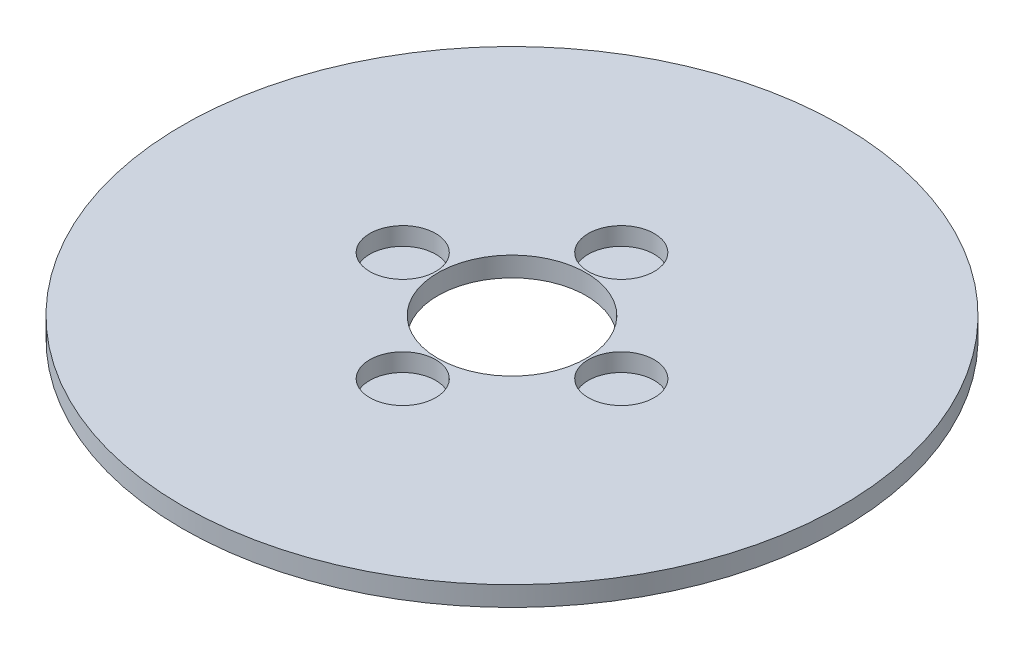
ISO-10303-21;
HEADER;
FILE_DESCRIPTION(('STEP AP214'),'2;1');
FILE_NAME('part.step','',(''),(''),'','','');
FILE_SCHEMA(('AUTOMOTIVE_DESIGN { 1 0 10303 214 1 1 1 1 }'));
ENDSEC;
DATA;
#1=APPLICATION_CONTEXT('core data for automotive mechanical design processes');
#2=APPLICATION_PROTOCOL_DEFINITION('international standard','automotive_design',2000,#1);
#3=PRODUCT_CONTEXT('',#1,'mechanical');
#4=PRODUCT('Part','Part','',(#3));
#5=PRODUCT_RELATED_PRODUCT_CATEGORY('part','',(#4));
#6=PRODUCT_DEFINITION_FORMATION('','',#4);
#7=PRODUCT_DEFINITION_CONTEXT('part definition',#1,'design');
#8=PRODUCT_DEFINITION('design','',#6,#7);
#9=PRODUCT_DEFINITION_SHAPE('','',#8);
#10=(LENGTH_UNIT() NAMED_UNIT(*) SI_UNIT(.MILLI.,.METRE.));
#11=(NAMED_UNIT(*) PLANE_ANGLE_UNIT() SI_UNIT($,.RADIAN.));
#12=(NAMED_UNIT(*) SI_UNIT($,.STERADIAN.) SOLID_ANGLE_UNIT());
#13=UNCERTAINTY_MEASURE_WITH_UNIT(LENGTH_MEASURE(1.E-05),#10,'distance_accuracy_value','');
#14=(GEOMETRIC_REPRESENTATION_CONTEXT(3) GLOBAL_UNCERTAINTY_ASSIGNED_CONTEXT((#13)) GLOBAL_UNIT_ASSIGNED_CONTEXT((#10,
#11,#12)) REPRESENTATION_CONTEXT('',''));
#15=CARTESIAN_POINT('',(0.,0.,0.));
#16=DIRECTION('',(0.,0.,1.));
#17=DIRECTION('',(1.,0.,0.));
#18=AXIS2_PLACEMENT_3D('',#15,#16,#17);
#19=CARTESIAN_POINT('',(0.,6.,0.));
#20=DIRECTION('',(0.,-1.,0.));
#21=DIRECTION('',(0.,0.,-1.));
#22=AXIS2_PLACEMENT_3D('',#19,#20,#21);
#23=CYLINDRICAL_SURFACE('',#22,100.);
#24=CARTESIAN_POINT('',(0.,6.,0.));
#25=DIRECTION('',(0.,1.,0.));
#26=DIRECTION('',(0.,0.,1.));
#27=AXIS2_PLACEMENT_3D('',#24,#25,#26);
#28=CIRCLE('',#27,100.);
#29=CARTESIAN_POINT('',(0.,6.,100.));
#30=VERTEX_POINT('',#29);
#31=EDGE_CURVE('E10',#30,#30,#28,.T.);
#32=ORIENTED_EDGE('',*,*,#31,.F.);
#33=EDGE_LOOP('',(#32));
#34=FACE_BOUND('',#33,.T.);
#35=CARTESIAN_POINT('',(0.,0.,0.));
#36=DIRECTION('',(0.,1.,0.));
#37=DIRECTION('',(0.,0.,1.));
#38=AXIS2_PLACEMENT_3D('',#35,#36,#37);
#39=CIRCLE('',#38,100.);
#40=CARTESIAN_POINT('',(0.,0.,100.));
#41=VERTEX_POINT('',#40);
#42=EDGE_CURVE('E37',#41,#41,#39,.T.);
#43=ORIENTED_EDGE('',*,*,#42,.T.);
#44=EDGE_LOOP('',(#43));
#45=FACE_BOUND('',#44,.T.);
#46=ADVANCED_FACE('F40',(#34,#45),#23,.T.);
#47=CARTESIAN_POINT('',(0.,6.,0.));
#48=DIRECTION('',(0.,1.,0.));
#49=DIRECTION('',(0.,0.,1.));
#50=AXIS2_PLACEMENT_3D('',#47,#48,#49);
#51=PLANE('',#50);
#52=CARTESIAN_POINT('',(1.1576770590935E-13,6.,33.1571887901622));
#53=DIRECTION('',(0.,1.,0.));
#54=DIRECTION('',(1.,0.,0.));
#55=AXIS2_PLACEMENT_3D('',#52,#53,#54);
#56=CIRCLE('',#55,10.);
#57=CARTESIAN_POINT('',(10.0000000000001,6.,33.1571887901622));
#58=VERTEX_POINT('',#57);
#59=EDGE_CURVE('E71',#58,#58,#56,.T.);
#60=ORIENTED_EDGE('',*,*,#59,.F.);
#61=EDGE_LOOP('',(#60));
#62=FACE_BOUND('',#61,.T.);
#63=CARTESIAN_POINT('',(33.1571887901622,6.,0.));
#64=DIRECTION('',(0.,1.,0.));
#65=DIRECTION('',(0.,0.,-1.));
#66=AXIS2_PLACEMENT_3D('',#63,#64,#65);
#67=CIRCLE('',#66,10.);
#68=CARTESIAN_POINT('',(33.1571887901622,6.,-10.));
#69=VERTEX_POINT('',#68);
#70=EDGE_CURVE('E70',#69,#69,#67,.T.);
#71=ORIENTED_EDGE('',*,*,#70,.F.);
#72=EDGE_LOOP('',(#71));
#73=FACE_BOUND('',#72,.T.);
#74=CARTESIAN_POINT('',(-3.4730311772805E-13,6.,-33.1571887901622));
#75=DIRECTION('',(0.,1.,0.));
#76=DIRECTION('',(-1.,0.,0.));
#77=AXIS2_PLACEMENT_3D('',#74,#75,#76);
#78=CIRCLE('',#77,10.);
#79=CARTESIAN_POINT('',(-10.0000000000003,6.,-33.1571887901621));
#80=VERTEX_POINT('',#79);
#81=EDGE_CURVE('E61',#80,#80,#78,.T.);
#82=ORIENTED_EDGE('',*,*,#81,.F.);
#83=EDGE_LOOP('',(#82));
#84=FACE_BOUND('',#83,.T.);
#85=CARTESIAN_POINT('',(-33.1571887901622,6.,0.));
#86=DIRECTION('',(0.,1.,0.));
#87=DIRECTION('',(0.,0.,1.));
#88=AXIS2_PLACEMENT_3D('',#85,#86,#87);
#89=CIRCLE('',#88,10.);
#90=CARTESIAN_POINT('',(-33.1571887901622,6.,10.));
#91=VERTEX_POINT('',#90);
#92=EDGE_CURVE('E54',#91,#91,#89,.T.);
#93=ORIENTED_EDGE('',*,*,#92,.F.);
#94=EDGE_LOOP('',(#93));
#95=FACE_BOUND('',#94,.T.);
#96=CARTESIAN_POINT('',(0.,6.,0.));
#97=DIRECTION('',(0.,1.,0.));
#98=DIRECTION('',(0.,0.,1.));
#99=AXIS2_PLACEMENT_3D('',#96,#97,#98);
#100=CIRCLE('',#99,22.5);
#101=CARTESIAN_POINT('',(0.,6.,22.5));
#102=VERTEX_POINT('',#101);
#103=EDGE_CURVE('E50',#102,#102,#100,.T.);
#104=ORIENTED_EDGE('',*,*,#103,.F.);
#105=EDGE_LOOP('',(#104));
#106=FACE_BOUND('',#105,.T.);
#107=ORIENTED_EDGE('',*,*,#31,.T.);
#108=EDGE_LOOP('',(#107));
#109=FACE_BOUND('',#108,.T.);
#110=ADVANCED_FACE('F86',(#62,#73,#84,#95,#106,#109),#51,.T.);
#111=CARTESIAN_POINT('',(0.,0.,0.));
#112=DIRECTION('',(0.,1.,0.));
#113=DIRECTION('',(0.,0.,1.));
#114=AXIS2_PLACEMENT_3D('',#111,#112,#113);
#115=PLANE('',#114);
#116=CARTESIAN_POINT('',(0.,0.,0.));
#117=DIRECTION('',(0.,1.,0.));
#118=DIRECTION('',(0.,0.,1.));
#119=AXIS2_PLACEMENT_3D('',#116,#117,#118);
#120=CIRCLE('',#119,22.5);
#121=CARTESIAN_POINT('',(0.,0.,22.5));
#122=VERTEX_POINT('',#121);
#123=EDGE_CURVE('E47',#122,#122,#120,.T.);
#124=ORIENTED_EDGE('',*,*,#123,.T.);
#125=EDGE_LOOP('',(#124));
#126=FACE_BOUND('',#125,.T.);
#127=ORIENTED_EDGE('',*,*,#42,.F.);
#128=EDGE_LOOP('',(#127));
#129=FACE_BOUND('',#128,.T.);
#130=ADVANCED_FACE('F93',(#126,#129),#115,.F.);
#131=CARTESIAN_POINT('',(0.,6.,0.));
#132=DIRECTION('',(0.,-1.,0.));
#133=DIRECTION('',(0.,0.,-1.));
#134=AXIS2_PLACEMENT_3D('',#131,#132,#133);
#135=CYLINDRICAL_SURFACE('',#134,22.5);
#136=ORIENTED_EDGE('',*,*,#103,.T.);
#137=EDGE_LOOP('',(#136));
#138=FACE_BOUND('',#137,.T.);
#139=ORIENTED_EDGE('',*,*,#123,.F.);
#140=EDGE_LOOP('',(#139));
#141=FACE_BOUND('',#140,.T.);
#142=ADVANCED_FACE('F101',(#138,#141),#135,.F.);
#143=CARTESIAN_POINT('',(-33.1571887901622,0.547731136969684,0.));
#144=DIRECTION('',(0.,1.,0.));
#145=DIRECTION('',(0.,0.,1.));
#146=AXIS2_PLACEMENT_3D('',#143,#144,#145);
#147=CYLINDRICAL_SURFACE('',#146,10.);
#148=CARTESIAN_POINT('',(-33.1571887901622,0.547731136969684,0.));
#149=DIRECTION('',(0.,1.,0.));
#150=DIRECTION('',(0.,0.,1.));
#151=AXIS2_PLACEMENT_3D('',#148,#149,#150);
#152=CIRCLE('',#151,10.);
#153=CARTESIAN_POINT('',(-33.1571887901622,0.547731136969684,10.));
#154=VERTEX_POINT('',#153);
#155=EDGE_CURVE('E55',#154,#154,#152,.T.);
#156=ORIENTED_EDGE('',*,*,#155,.F.);
#157=EDGE_LOOP('',(#156));
#158=FACE_BOUND('',#157,.T.);
#159=ORIENTED_EDGE('',*,*,#92,.T.);
#160=EDGE_LOOP('',(#159));
#161=FACE_BOUND('',#160,.T.);
#162=ADVANCED_FACE('F102',(#158,#161),#147,.F.);
#163=CARTESIAN_POINT('',(-33.1571887901622,0.547731136969684,0.));
#164=DIRECTION('',(0.,1.,0.));
#165=DIRECTION('',(0.,0.,1.));
#166=AXIS2_PLACEMENT_3D('',#163,#164,#165);
#167=PLANE('',#166);
#168=ORIENTED_EDGE('',*,*,#155,.T.);
#169=EDGE_LOOP('',(#168));
#170=FACE_BOUND('',#169,.T.);
#171=ADVANCED_FACE('F133',(#170),#167,.T.);
#172=CARTESIAN_POINT('',(-3.4730311772805E-13,0.547731136969684,-33.1571887901622));
#173=DIRECTION('',(0.,1.,0.));
#174=DIRECTION('',(0.,0.,1.));
#175=AXIS2_PLACEMENT_3D('',#172,#173,#174);
#176=CYLINDRICAL_SURFACE('',#175,10.);
#177=CARTESIAN_POINT('',(-3.4730311772805E-13,0.547731136969684,-33.1571887901622));
#178=DIRECTION('',(0.,1.,0.));
#179=DIRECTION('',(-1.,0.,0.));
#180=AXIS2_PLACEMENT_3D('',#177,#178,#179);
#181=CIRCLE('',#180,10.);
#182=CARTESIAN_POINT('',(-10.0000000000003,0.547731136969684,-33.1571887901621));
#183=VERTEX_POINT('',#182);
#184=EDGE_CURVE('E63',#183,#183,#181,.T.);
#185=ORIENTED_EDGE('',*,*,#184,.F.);
#186=EDGE_LOOP('',(#185));
#187=FACE_BOUND('',#186,.T.);
#188=ORIENTED_EDGE('',*,*,#81,.T.);
#189=EDGE_LOOP('',(#188));
#190=FACE_BOUND('',#189,.T.);
#191=ADVANCED_FACE('F142',(#187,#190),#176,.F.);
#192=CARTESIAN_POINT('',(-3.4730311772805E-13,0.547731136969684,-33.1571887901622));
#193=DIRECTION('',(0.,1.,0.));
#194=DIRECTION('',(-1.,0.,0.));
#195=AXIS2_PLACEMENT_3D('',#192,#193,#194);
#196=PLANE('',#195);
#197=ORIENTED_EDGE('',*,*,#184,.T.);
#198=EDGE_LOOP('',(#197));
#199=FACE_BOUND('',#198,.T.);
#200=ADVANCED_FACE('F156',(#199),#196,.T.);
#201=CARTESIAN_POINT('',(33.1571887901622,0.547731136969684,0.));
#202=DIRECTION('',(0.,1.,0.));
#203=DIRECTION('',(0.,0.,1.));
#204=AXIS2_PLACEMENT_3D('',#201,#202,#203);
#205=CYLINDRICAL_SURFACE('',#204,10.);
#206=CARTESIAN_POINT('',(33.1571887901622,0.547731136969684,0.));
#207=DIRECTION('',(0.,1.,0.));
#208=DIRECTION('',(0.,0.,-1.));
#209=AXIS2_PLACEMENT_3D('',#206,#207,#208);
#210=CIRCLE('',#209,10.);
#211=CARTESIAN_POINT('',(33.1571887901622,0.547731136969684,-10.));
#212=VERTEX_POINT('',#211);
#213=EDGE_CURVE('E69',#212,#212,#210,.T.);
#214=ORIENTED_EDGE('',*,*,#213,.F.);
#215=EDGE_LOOP('',(#214));
#216=FACE_BOUND('',#215,.T.);
#217=ORIENTED_EDGE('',*,*,#70,.T.);
#218=EDGE_LOOP('',(#217));
#219=FACE_BOUND('',#218,.T.);
#220=ADVANCED_FACE('F164',(#216,#219),#205,.F.);
#221=CARTESIAN_POINT('',(33.1571887901622,0.547731136969684,0.));
#222=DIRECTION('',(0.,1.,0.));
#223=DIRECTION('',(0.,0.,-1.));
#224=AXIS2_PLACEMENT_3D('',#221,#222,#223);
#225=PLANE('',#224);
#226=ORIENTED_EDGE('',*,*,#213,.T.);
#227=EDGE_LOOP('',(#226));
#228=FACE_BOUND('',#227,.T.);
#229=ADVANCED_FACE('F83',(#228),#225,.T.);
#230=CARTESIAN_POINT('',(1.1576770590935E-13,0.547731136969684,33.1571887901622));
#231=DIRECTION('',(0.,1.,0.));
#232=DIRECTION('',(0.,0.,1.));
#233=AXIS2_PLACEMENT_3D('',#230,#231,#232);
#234=CYLINDRICAL_SURFACE('',#233,10.);
#235=CARTESIAN_POINT('',(1.1576770590935E-13,0.547731136969684,33.1571887901622));
#236=DIRECTION('',(0.,1.,0.));
#237=DIRECTION('',(1.,0.,0.));
#238=AXIS2_PLACEMENT_3D('',#235,#236,#237);
#239=CIRCLE('',#238,10.);
#240=CARTESIAN_POINT('',(10.0000000000001,0.547731136969684,33.1571887901622));
#241=VERTEX_POINT('',#240);
#242=EDGE_CURVE('E59',#241,#241,#239,.T.);
#243=ORIENTED_EDGE('',*,*,#242,.F.);
#244=EDGE_LOOP('',(#243));
#245=FACE_BOUND('',#244,.T.);
#246=ORIENTED_EDGE('',*,*,#59,.T.);
#247=EDGE_LOOP('',(#246));
#248=FACE_BOUND('',#247,.T.);
#249=ADVANCED_FACE('F81',(#245,#248),#234,.F.);
#250=CARTESIAN_POINT('',(1.1576770590935E-13,0.547731136969684,33.1571887901622));
#251=DIRECTION('',(0.,1.,0.));
#252=DIRECTION('',(1.,0.,0.));
#253=AXIS2_PLACEMENT_3D('',#250,#251,#252);
#254=PLANE('',#253);
#255=ORIENTED_EDGE('',*,*,#242,.T.);
#256=EDGE_LOOP('',(#255));
#257=FACE_BOUND('',#256,.T.);
#258=ADVANCED_FACE('F78',(#257),#254,.T.);
#259=CLOSED_SHELL('',(#46,#110,#130,#142,#162,#171,#191,#200,#220,#229,#249,#258));
#260=MANIFOLD_SOLID_BREP('B2',#259);
#261=ADVANCED_BREP_SHAPE_REPRESENTATION('',(#18,#260),#14);
#262=SHAPE_DEFINITION_REPRESENTATION(#9,#261);
ENDSEC;
END-ISO-10303-21;
